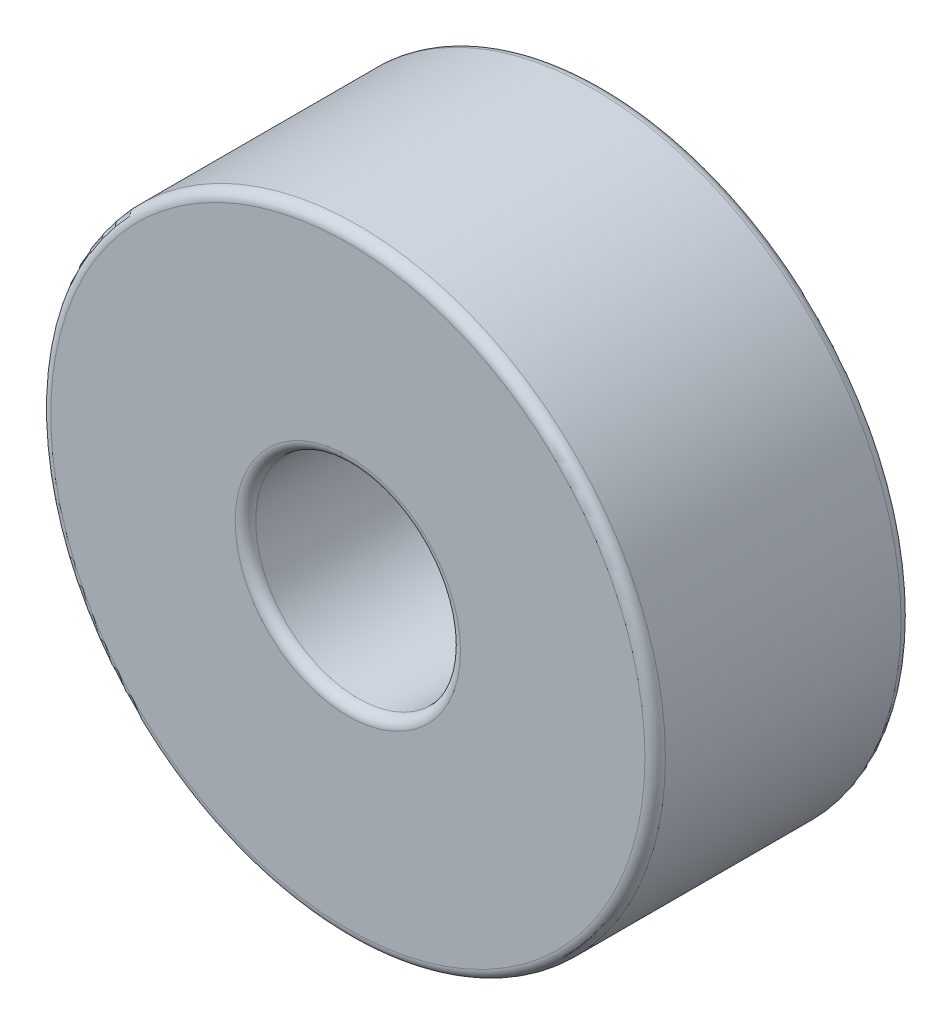
ISO-10303-21;
HEADER;
FILE_DESCRIPTION(('STEP AP214'),'2;1');
FILE_NAME('part.step','',(''),(''),'','','');
FILE_SCHEMA(('AUTOMOTIVE_DESIGN { 1 0 10303 214 1 1 1 1 }'));
ENDSEC;
DATA;
#1=APPLICATION_CONTEXT('core data for automotive mechanical design processes');
#2=APPLICATION_PROTOCOL_DEFINITION('international standard','automotive_design',2000,#1);
#3=PRODUCT_CONTEXT('',#1,'mechanical');
#4=PRODUCT('Part','Part','',(#3));
#5=PRODUCT_RELATED_PRODUCT_CATEGORY('part','',(#4));
#6=PRODUCT_DEFINITION_FORMATION('','',#4);
#7=PRODUCT_DEFINITION_CONTEXT('part definition',#1,'design');
#8=PRODUCT_DEFINITION('design','',#6,#7);
#9=PRODUCT_DEFINITION_SHAPE('','',#8);
#10=(LENGTH_UNIT() NAMED_UNIT(*) SI_UNIT(.MILLI.,.METRE.));
#11=(NAMED_UNIT(*) PLANE_ANGLE_UNIT() SI_UNIT($,.RADIAN.));
#12=(NAMED_UNIT(*) SI_UNIT($,.STERADIAN.) SOLID_ANGLE_UNIT());
#13=UNCERTAINTY_MEASURE_WITH_UNIT(LENGTH_MEASURE(1.E-05),#10,'distance_accuracy_value','');
#14=(GEOMETRIC_REPRESENTATION_CONTEXT(3) GLOBAL_UNCERTAINTY_ASSIGNED_CONTEXT((#13)) GLOBAL_UNIT_ASSIGNED_CONTEXT((#10,
#11,#12)) REPRESENTATION_CONTEXT('',''));
#15=CARTESIAN_POINT('',(0.,0.,0.));
#16=DIRECTION('',(0.,0.,1.));
#17=DIRECTION('',(1.,0.,0.));
#18=AXIS2_PLACEMENT_3D('',#15,#16,#17);
#19=CARTESIAN_POINT('',(0.,0.,2.5));
#20=DIRECTION('',(0.,0.,1.));
#21=DIRECTION('',(1.,0.,0.));
#22=AXIS2_PLACEMENT_3D('',#19,#20,#21);
#23=PLANE('',#22);
#24=CARTESIAN_POINT('',(0.,0.,2.5));
#25=DIRECTION('',(0.,0.,1.));
#26=DIRECTION('',(1.,0.,0.));
#27=AXIS2_PLACEMENT_3D('',#24,#25,#26);
#28=CIRCLE('',#27,1.1);
#29=CARTESIAN_POINT('',(1.1,0.,2.5));
#30=VERTEX_POINT('',#29);
#31=EDGE_CURVE('E50',#30,#30,#28,.F.);
#32=ORIENTED_EDGE('',*,*,#31,.T.);
#33=EDGE_LOOP('',(#32));
#34=FACE_BOUND('',#33,.T.);
#35=CARTESIAN_POINT('',(0.,0.,2.5));
#36=DIRECTION('',(0.,0.,1.));
#37=DIRECTION('',(1.,0.,0.));
#38=AXIS2_PLACEMENT_3D('',#35,#36,#37);
#39=CIRCLE('',#38,2.9);
#40=CARTESIAN_POINT('',(2.9,0.,2.5));
#41=VERTEX_POINT('',#40);
#42=EDGE_CURVE('E78',#41,#41,#39,.T.);
#43=ORIENTED_EDGE('',*,*,#42,.T.);
#44=EDGE_LOOP('',(#43));
#45=FACE_BOUND('',#44,.T.);
#46=ADVANCED_FACE('F42',(#34,#45),#23,.T.);
#47=CARTESIAN_POINT('',(0.,0.,0.));
#48=DIRECTION('',(0.,0.,1.));
#49=DIRECTION('',(1.,0.,0.));
#50=AXIS2_PLACEMENT_3D('',#47,#48,#49);
#51=PLANE('',#50);
#52=CARTESIAN_POINT('',(0.,0.,0.));
#53=DIRECTION('',(0.,0.,1.));
#54=DIRECTION('',(1.,0.,0.));
#55=AXIS2_PLACEMENT_3D('',#52,#53,#54);
#56=CIRCLE('',#55,1.1);
#57=CARTESIAN_POINT('',(1.1,0.,0.));
#58=VERTEX_POINT('',#57);
#59=EDGE_CURVE('E66',#58,#58,#56,.T.);
#60=ORIENTED_EDGE('',*,*,#59,.T.);
#61=EDGE_LOOP('',(#60));
#62=FACE_BOUND('',#61,.T.);
#63=CARTESIAN_POINT('',(0.,0.,0.));
#64=DIRECTION('',(0.,0.,1.));
#65=DIRECTION('',(1.,0.,0.));
#66=AXIS2_PLACEMENT_3D('',#63,#64,#65);
#67=CIRCLE('',#66,2.9);
#68=CARTESIAN_POINT('',(2.9,0.,0.));
#69=VERTEX_POINT('',#68);
#70=EDGE_CURVE('E70',#69,#69,#67,.F.);
#71=ORIENTED_EDGE('',*,*,#70,.T.);
#72=EDGE_LOOP('',(#71));
#73=FACE_BOUND('',#72,.T.);
#74=ADVANCED_FACE('F103',(#62,#73),#51,.F.);
#75=CARTESIAN_POINT('',(0.,0.,2.5));
#76=DIRECTION('',(0.,0.,-1.));
#77=DIRECTION('',(-1.,0.,0.));
#78=AXIS2_PLACEMENT_3D('',#75,#76,#77);
#79=CYLINDRICAL_SURFACE('',#78,3.);
#80=CARTESIAN_POINT('',(0.,0.,0.0999999999999998));
#81=DIRECTION('',(0.,0.,1.));
#82=DIRECTION('',(1.,0.,0.));
#83=AXIS2_PLACEMENT_3D('',#80,#81,#82);
#84=CIRCLE('',#83,3.);
#85=CARTESIAN_POINT('',(3.,0.,0.0999999999999998));
#86=VERTEX_POINT('',#85);
#87=EDGE_CURVE('E10',#86,#86,#84,.T.);
#88=ORIENTED_EDGE('',*,*,#87,.T.);
#89=EDGE_LOOP('',(#88));
#90=FACE_BOUND('',#89,.T.);
#91=CARTESIAN_POINT('',(0.,0.,2.4));
#92=DIRECTION('',(0.,0.,1.));
#93=DIRECTION('',(1.,0.,0.));
#94=AXIS2_PLACEMENT_3D('',#91,#92,#93);
#95=CIRCLE('',#94,3.);
#96=CARTESIAN_POINT('',(3.,0.,2.4));
#97=VERTEX_POINT('',#96);
#98=EDGE_CURVE('E74',#97,#97,#95,.F.);
#99=ORIENTED_EDGE('',*,*,#98,.T.);
#100=EDGE_LOOP('',(#99));
#101=FACE_BOUND('',#100,.T.);
#102=ADVANCED_FACE('F97',(#90,#101),#79,.T.);
#103=CARTESIAN_POINT('',(0.,0.,2.5));
#104=DIRECTION('',(0.,0.,-1.));
#105=DIRECTION('',(-1.,0.,0.));
#106=AXIS2_PLACEMENT_3D('',#103,#104,#105);
#107=CYLINDRICAL_SURFACE('',#106,1.);
#108=CARTESIAN_POINT('',(0.,0.,0.0999999999999998));
#109=DIRECTION('',(0.,0.,1.));
#110=DIRECTION('',(1.,0.,0.));
#111=AXIS2_PLACEMENT_3D('',#108,#109,#110);
#112=CIRCLE('',#111,1.);
#113=CARTESIAN_POINT('',(1.,0.,0.0999999999999998));
#114=VERTEX_POINT('',#113);
#115=EDGE_CURVE('E55',#114,#114,#112,.F.);
#116=ORIENTED_EDGE('',*,*,#115,.T.);
#117=EDGE_LOOP('',(#116));
#118=FACE_BOUND('',#117,.T.);
#119=CARTESIAN_POINT('',(0.,0.,2.4));
#120=DIRECTION('',(0.,0.,1.));
#121=DIRECTION('',(1.,0.,0.));
#122=AXIS2_PLACEMENT_3D('',#119,#120,#121);
#123=CIRCLE('',#122,1.);
#124=CARTESIAN_POINT('',(1.,0.,2.4));
#125=VERTEX_POINT('',#124);
#126=EDGE_CURVE('E60',#125,#125,#123,.T.);
#127=ORIENTED_EDGE('',*,*,#126,.T.);
#128=EDGE_LOOP('',(#127));
#129=FACE_BOUND('',#128,.T.);
#130=ADVANCED_FACE('F87',(#118,#129),#107,.F.);
#131=CARTESIAN_POINT('',(0.,0.,2.4));
#132=DIRECTION('',(0.,0.,1.));
#133=DIRECTION('',(1.,0.,0.));
#134=AXIS2_PLACEMENT_3D('',#131,#132,#133);
#135=TOROIDAL_SURFACE('',#134,2.9,0.1);
#136=ORIENTED_EDGE('',*,*,#98,.F.);
#137=EDGE_LOOP('',(#136));
#138=FACE_BOUND('',#137,.T.);
#139=ORIENTED_EDGE('',*,*,#42,.F.);
#140=EDGE_LOOP('',(#139));
#141=FACE_BOUND('',#140,.T.);
#142=ADVANCED_FACE('F84',(#138,#141),#135,.T.);
#143=CARTESIAN_POINT('',(0.,0.,0.0999999999999998));
#144=DIRECTION('',(0.,0.,1.));
#145=DIRECTION('',(1.,0.,0.));
#146=AXIS2_PLACEMENT_3D('',#143,#144,#145);
#147=TOROIDAL_SURFACE('',#146,1.1,0.1);
#148=ORIENTED_EDGE('',*,*,#115,.F.);
#149=EDGE_LOOP('',(#148));
#150=FACE_BOUND('',#149,.T.);
#151=ORIENTED_EDGE('',*,*,#59,.F.);
#152=EDGE_LOOP('',(#151));
#153=FACE_BOUND('',#152,.T.);
#154=ADVANCED_FACE('F86',(#150,#153),#147,.T.);
#155=CARTESIAN_POINT('',(0.,0.,2.4));
#156=DIRECTION('',(0.,0.,1.));
#157=DIRECTION('',(1.,0.,0.));
#158=AXIS2_PLACEMENT_3D('',#155,#156,#157);
#159=TOROIDAL_SURFACE('',#158,1.1,0.1);
#160=ORIENTED_EDGE('',*,*,#31,.F.);
#161=EDGE_LOOP('',(#160));
#162=FACE_BOUND('',#161,.T.);
#163=ORIENTED_EDGE('',*,*,#126,.F.);
#164=EDGE_LOOP('',(#163));
#165=FACE_BOUND('',#164,.T.);
#166=ADVANCED_FACE('F94',(#162,#165),#159,.T.);
#167=CARTESIAN_POINT('',(0.,0.,0.0999999999999998));
#168=DIRECTION('',(0.,0.,1.));
#169=DIRECTION('',(1.,0.,0.));
#170=AXIS2_PLACEMENT_3D('',#167,#168,#169);
#171=TOROIDAL_SURFACE('',#170,2.9,0.1);
#172=ORIENTED_EDGE('',*,*,#70,.F.);
#173=EDGE_LOOP('',(#172));
#174=FACE_BOUND('',#173,.T.);
#175=ORIENTED_EDGE('',*,*,#87,.F.);
#176=EDGE_LOOP('',(#175));
#177=FACE_BOUND('',#176,.T.);
#178=ADVANCED_FACE('F44',(#174,#177),#171,.T.);
#179=CLOSED_SHELL('',(#46,#74,#102,#130,#142,#154,#166,#178));
#180=MANIFOLD_SOLID_BREP('B2',#179);
#181=ADVANCED_BREP_SHAPE_REPRESENTATION('',(#18,#180),#14);
#182=SHAPE_DEFINITION_REPRESENTATION(#9,#181);
ENDSEC;
END-ISO-10303-21;
